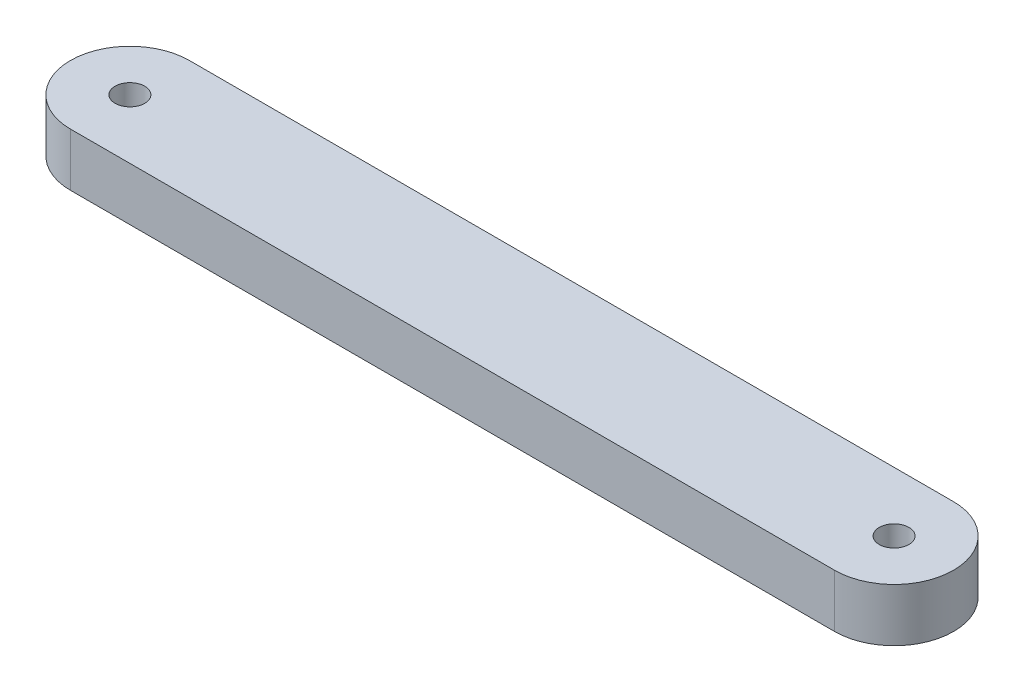
ISO-10303-21;
HEADER;
FILE_DESCRIPTION(('STEP AP214'),'2;1');
FILE_NAME('part.step','',(''),(''),'','','');
FILE_SCHEMA(('AUTOMOTIVE_DESIGN { 1 0 10303 214 1 1 1 1 }'));
ENDSEC;
DATA;
#1=APPLICATION_CONTEXT('core data for automotive mechanical design processes');
#2=APPLICATION_PROTOCOL_DEFINITION('international standard','automotive_design',2000,#1);
#3=PRODUCT_CONTEXT('',#1,'mechanical');
#4=PRODUCT('Part','Part','',(#3));
#5=PRODUCT_RELATED_PRODUCT_CATEGORY('part','',(#4));
#6=PRODUCT_DEFINITION_FORMATION('','',#4);
#7=PRODUCT_DEFINITION_CONTEXT('part definition',#1,'design');
#8=PRODUCT_DEFINITION('design','',#6,#7);
#9=PRODUCT_DEFINITION_SHAPE('','',#8);
#10=(LENGTH_UNIT() NAMED_UNIT(*) SI_UNIT(.MILLI.,.METRE.));
#11=(NAMED_UNIT(*) PLANE_ANGLE_UNIT() SI_UNIT($,.RADIAN.));
#12=(NAMED_UNIT(*) SI_UNIT($,.STERADIAN.) SOLID_ANGLE_UNIT());
#13=UNCERTAINTY_MEASURE_WITH_UNIT(LENGTH_MEASURE(1.E-05),#10,'distance_accuracy_value','');
#14=(GEOMETRIC_REPRESENTATION_CONTEXT(3) GLOBAL_UNCERTAINTY_ASSIGNED_CONTEXT((#13)) GLOBAL_UNIT_ASSIGNED_CONTEXT((#10,
#11,#12)) REPRESENTATION_CONTEXT('',''));
#15=CARTESIAN_POINT('',(0.,0.,0.));
#16=DIRECTION('',(0.,0.,1.));
#17=DIRECTION('',(1.,0.,0.));
#18=AXIS2_PLACEMENT_3D('',#15,#16,#17);
#19=CARTESIAN_POINT('',(0.,25.,28.));
#20=DIRECTION('',(0.,0.,1.));
#21=DIRECTION('',(1.,0.,0.));
#22=AXIS2_PLACEMENT_3D('',#19,#20,#21);
#23=PLANE('',#22);
#24=DIRECTION('',(-1.,0.,0.));
#25=VECTOR('',#24,1.);
#26=CARTESIAN_POINT('',(0.,0.,28.));
#27=LINE('',#26,#25);
#28=CARTESIAN_POINT('',(180.,0.,28.));
#29=VERTEX_POINT('',#28);
#30=CARTESIAN_POINT('',(-180.,0.,28.));
#31=VERTEX_POINT('',#30);
#32=EDGE_CURVE('E110',#29,#31,#27,.T.);
#33=ORIENTED_EDGE('',*,*,#32,.F.);
#34=DIRECTION('',(0.,-1.,0.));
#35=VECTOR('',#34,1.);
#36=CARTESIAN_POINT('',(180.,25.,28.));
#37=LINE('',#36,#35);
#38=CARTESIAN_POINT('',(180.,25.,28.));
#39=VERTEX_POINT('',#38);
#40=EDGE_CURVE('E11',#39,#29,#37,.T.);
#41=ORIENTED_EDGE('',*,*,#40,.F.);
#42=DIRECTION('',(-1.,0.,0.));
#43=VECTOR('',#42,1.);
#44=CARTESIAN_POINT('',(0.,25.,28.));
#45=LINE('',#44,#43);
#46=CARTESIAN_POINT('',(-180.,25.,28.));
#47=VERTEX_POINT('',#46);
#48=EDGE_CURVE('E97',#39,#47,#45,.T.);
#49=ORIENTED_EDGE('',*,*,#48,.T.);
#50=DIRECTION('',(0.,-1.,0.));
#51=VECTOR('',#50,1.);
#52=CARTESIAN_POINT('',(-180.,25.,28.));
#53=LINE('',#52,#51);
#54=EDGE_CURVE('E78',#47,#31,#53,.T.);
#55=ORIENTED_EDGE('',*,*,#54,.T.);
#56=EDGE_LOOP('',(#33,#41,#49,#55));
#57=FACE_BOUND('',#56,.T.);
#58=ADVANCED_FACE('F40',(#57),#23,.T.);
#59=CARTESIAN_POINT('',(180.,25.,0.));
#60=DIRECTION('',(0.,-1.,0.));
#61=DIRECTION('',(0.,0.,-1.));
#62=AXIS2_PLACEMENT_3D('',#59,#60,#61);
#63=CYLINDRICAL_SURFACE('',#62,28.);
#64=CARTESIAN_POINT('',(180.,0.,0.));
#65=DIRECTION('',(0.,1.,0.));
#66=DIRECTION('',(0.,0.,1.));
#67=AXIS2_PLACEMENT_3D('',#64,#65,#66);
#68=CIRCLE('',#67,28.);
#69=CARTESIAN_POINT('',(180.,0.,-28.));
#70=VERTEX_POINT('',#69);
#71=EDGE_CURVE('E89',#70,#29,#68,.F.);
#72=ORIENTED_EDGE('',*,*,#71,.F.);
#73=DIRECTION('',(0.,-1.,0.));
#74=VECTOR('',#73,1.);
#75=CARTESIAN_POINT('',(180.,25.,-28.));
#76=LINE('',#75,#74);
#77=CARTESIAN_POINT('',(180.,25.,-28.));
#78=VERTEX_POINT('',#77);
#79=EDGE_CURVE('E48',#78,#70,#76,.T.);
#80=ORIENTED_EDGE('',*,*,#79,.F.);
#81=CARTESIAN_POINT('',(180.,25.,0.));
#82=DIRECTION('',(0.,1.,0.));
#83=DIRECTION('',(0.,0.,1.));
#84=AXIS2_PLACEMENT_3D('',#81,#82,#83);
#85=CIRCLE('',#84,28.);
#86=EDGE_CURVE('E87',#78,#39,#85,.F.);
#87=ORIENTED_EDGE('',*,*,#86,.T.);
#88=ORIENTED_EDGE('',*,*,#40,.T.);
#89=EDGE_LOOP('',(#72,#80,#87,#88));
#90=FACE_BOUND('',#89,.T.);
#91=ADVANCED_FACE('F86',(#90),#63,.T.);
#92=CARTESIAN_POINT('',(0.,25.,-28.));
#93=DIRECTION('',(0.,0.,-1.));
#94=DIRECTION('',(-1.,0.,0.));
#95=AXIS2_PLACEMENT_3D('',#92,#93,#94);
#96=PLANE('',#95);
#97=DIRECTION('',(1.,0.,0.));
#98=VECTOR('',#97,1.);
#99=CARTESIAN_POINT('',(0.,0.,-28.));
#100=LINE('',#99,#98);
#101=CARTESIAN_POINT('',(-180.,0.,-28.));
#102=VERTEX_POINT('',#101);
#103=EDGE_CURVE('E114',#102,#70,#100,.T.);
#104=ORIENTED_EDGE('',*,*,#103,.F.);
#105=DIRECTION('',(0.,-1.,0.));
#106=VECTOR('',#105,1.);
#107=CARTESIAN_POINT('',(-180.,25.,-28.));
#108=LINE('',#107,#106);
#109=CARTESIAN_POINT('',(-180.,25.,-28.));
#110=VERTEX_POINT('',#109);
#111=EDGE_CURVE('E71',#110,#102,#108,.T.);
#112=ORIENTED_EDGE('',*,*,#111,.F.);
#113=DIRECTION('',(1.,0.,0.));
#114=VECTOR('',#113,1.);
#115=CARTESIAN_POINT('',(0.,25.,-28.));
#116=LINE('',#115,#114);
#117=EDGE_CURVE('E96',#110,#78,#116,.T.);
#118=ORIENTED_EDGE('',*,*,#117,.T.);
#119=ORIENTED_EDGE('',*,*,#79,.T.);
#120=EDGE_LOOP('',(#104,#112,#118,#119));
#121=FACE_BOUND('',#120,.T.);
#122=ADVANCED_FACE('F99',(#121),#96,.T.);
#123=CARTESIAN_POINT('',(-180.,25.,0.));
#124=DIRECTION('',(0.,-1.,0.));
#125=DIRECTION('',(0.,0.,-1.));
#126=AXIS2_PLACEMENT_3D('',#123,#124,#125);
#127=CYLINDRICAL_SURFACE('',#126,7.00000000000001);
#128=CARTESIAN_POINT('',(-180.,25.,0.));
#129=DIRECTION('',(0.,1.,0.));
#130=DIRECTION('',(0.,0.,1.));
#131=AXIS2_PLACEMENT_3D('',#128,#129,#130);
#132=CIRCLE('',#131,7.00000000000001);
#133=CARTESIAN_POINT('',(-180.,25.,7.00000000000001));
#134=VERTEX_POINT('',#133);
#135=EDGE_CURVE('E101',#134,#134,#132,.T.);
#136=ORIENTED_EDGE('',*,*,#135,.T.);
#137=EDGE_LOOP('',(#136));
#138=FACE_BOUND('',#137,.T.);
#139=CARTESIAN_POINT('',(-180.,0.,0.));
#140=DIRECTION('',(0.,1.,0.));
#141=DIRECTION('',(0.,0.,1.));
#142=AXIS2_PLACEMENT_3D('',#139,#140,#141);
#143=CIRCLE('',#142,7.00000000000001);
#144=CARTESIAN_POINT('',(-180.,0.,7.00000000000001));
#145=VERTEX_POINT('',#144);
#146=EDGE_CURVE('E118',#145,#145,#143,.T.);
#147=ORIENTED_EDGE('',*,*,#146,.F.);
#148=EDGE_LOOP('',(#147));
#149=FACE_BOUND('',#148,.T.);
#150=ADVANCED_FACE('F134',(#138,#149),#127,.F.);
#151=CARTESIAN_POINT('',(-180.,25.,0.));
#152=DIRECTION('',(0.,-1.,0.));
#153=DIRECTION('',(0.,0.,-1.));
#154=AXIS2_PLACEMENT_3D('',#151,#152,#153);
#155=CYLINDRICAL_SURFACE('',#154,28.);
#156=CARTESIAN_POINT('',(-180.,0.,0.));
#157=DIRECTION('',(0.,1.,0.));
#158=DIRECTION('',(0.,0.,1.));
#159=AXIS2_PLACEMENT_3D('',#156,#157,#158);
#160=CIRCLE('',#159,28.);
#161=EDGE_CURVE('E116',#102,#31,#160,.T.);
#162=ORIENTED_EDGE('',*,*,#161,.T.);
#163=ORIENTED_EDGE('',*,*,#54,.F.);
#164=CARTESIAN_POINT('',(-180.,25.,0.));
#165=DIRECTION('',(0.,1.,0.));
#166=DIRECTION('',(0.,0.,1.));
#167=AXIS2_PLACEMENT_3D('',#164,#165,#166);
#168=CIRCLE('',#167,28.);
#169=EDGE_CURVE('E56',#110,#47,#168,.T.);
#170=ORIENTED_EDGE('',*,*,#169,.F.);
#171=ORIENTED_EDGE('',*,*,#111,.T.);
#172=EDGE_LOOP('',(#162,#163,#170,#171));
#173=FACE_BOUND('',#172,.T.);
#174=ADVANCED_FACE('F137',(#173),#155,.T.);
#175=CARTESIAN_POINT('',(180.,25.,0.));
#176=DIRECTION('',(0.,-1.,0.));
#177=DIRECTION('',(0.,0.,-1.));
#178=AXIS2_PLACEMENT_3D('',#175,#176,#177);
#179=CYLINDRICAL_SURFACE('',#178,7.00000000000001);
#180=CARTESIAN_POINT('',(180.,25.,0.));
#181=DIRECTION('',(0.,1.,0.));
#182=DIRECTION('',(0.,0.,1.));
#183=AXIS2_PLACEMENT_3D('',#180,#181,#182);
#184=CIRCLE('',#183,7.00000000000001);
#185=CARTESIAN_POINT('',(180.,25.,7.00000000000001));
#186=VERTEX_POINT('',#185);
#187=EDGE_CURVE('E107',#186,#186,#184,.F.);
#188=ORIENTED_EDGE('',*,*,#187,.F.);
#189=EDGE_LOOP('',(#188));
#190=FACE_BOUND('',#189,.T.);
#191=CARTESIAN_POINT('',(180.,0.,0.));
#192=DIRECTION('',(0.,1.,0.));
#193=DIRECTION('',(0.,0.,1.));
#194=AXIS2_PLACEMENT_3D('',#191,#192,#193);
#195=CIRCLE('',#194,7.00000000000001);
#196=CARTESIAN_POINT('',(180.,0.,7.00000000000001));
#197=VERTEX_POINT('',#196);
#198=EDGE_CURVE('E121',#197,#197,#195,.F.);
#199=ORIENTED_EDGE('',*,*,#198,.T.);
#200=EDGE_LOOP('',(#199));
#201=FACE_BOUND('',#200,.T.);
#202=ADVANCED_FACE('F140',(#190,#201),#179,.F.);
#203=CARTESIAN_POINT('',(0.,25.,0.));
#204=DIRECTION('',(0.,1.,0.));
#205=DIRECTION('',(0.,0.,1.));
#206=AXIS2_PLACEMENT_3D('',#203,#204,#205);
#207=PLANE('',#206);
#208=ORIENTED_EDGE('',*,*,#48,.F.);
#209=ORIENTED_EDGE('',*,*,#86,.F.);
#210=ORIENTED_EDGE('',*,*,#117,.F.);
#211=ORIENTED_EDGE('',*,*,#169,.T.);
#212=EDGE_LOOP('',(#208,#209,#210,#211));
#213=FACE_BOUND('',#212,.T.);
#214=ORIENTED_EDGE('',*,*,#135,.F.);
#215=EDGE_LOOP('',(#214));
#216=FACE_BOUND('',#215,.T.);
#217=ORIENTED_EDGE('',*,*,#187,.T.);
#218=EDGE_LOOP('',(#217));
#219=FACE_BOUND('',#218,.T.);
#220=ADVANCED_FACE('F94',(#213,#216,#219),#207,.T.);
#221=CARTESIAN_POINT('',(0.,0.,0.));
#222=DIRECTION('',(0.,1.,0.));
#223=DIRECTION('',(0.,0.,1.));
#224=AXIS2_PLACEMENT_3D('',#221,#222,#223);
#225=PLANE('',#224);
#226=ORIENTED_EDGE('',*,*,#32,.T.);
#227=ORIENTED_EDGE('',*,*,#161,.F.);
#228=ORIENTED_EDGE('',*,*,#103,.T.);
#229=ORIENTED_EDGE('',*,*,#71,.T.);
#230=EDGE_LOOP('',(#226,#227,#228,#229));
#231=FACE_BOUND('',#230,.T.);
#232=ORIENTED_EDGE('',*,*,#146,.T.);
#233=EDGE_LOOP('',(#232));
#234=FACE_BOUND('',#233,.T.);
#235=ORIENTED_EDGE('',*,*,#198,.F.);
#236=EDGE_LOOP('',(#235));
#237=FACE_BOUND('',#236,.T.);
#238=ADVANCED_FACE('F147',(#231,#234,#237),#225,.F.);
#239=CLOSED_SHELL('',(#58,#91,#122,#150,#174,#202,#220,#238));
#240=MANIFOLD_SOLID_BREP('B2',#239);
#241=ADVANCED_BREP_SHAPE_REPRESENTATION('',(#18,#240),#14);
#242=SHAPE_DEFINITION_REPRESENTATION(#9,#241);
ENDSEC;
END-ISO-10303-21;
